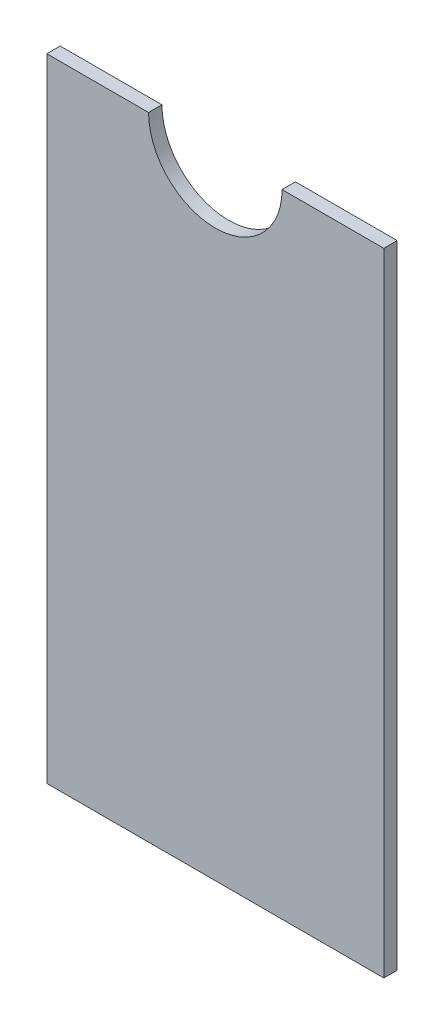
ISO-10303-21;
HEADER;
FILE_DESCRIPTION(('STEP AP214'),'2;1');
FILE_NAME('part.step','',(''),(''),'','','');
FILE_SCHEMA(('AUTOMOTIVE_DESIGN { 1 0 10303 214 1 1 1 1 }'));
ENDSEC;
DATA;
#1=APPLICATION_CONTEXT('core data for automotive mechanical design processes');
#2=APPLICATION_PROTOCOL_DEFINITION('international standard','automotive_design',2000,#1);
#3=PRODUCT_CONTEXT('',#1,'mechanical');
#4=PRODUCT('Part','Part','',(#3));
#5=PRODUCT_RELATED_PRODUCT_CATEGORY('part','',(#4));
#6=PRODUCT_DEFINITION_FORMATION('','',#4);
#7=PRODUCT_DEFINITION_CONTEXT('part definition',#1,'design');
#8=PRODUCT_DEFINITION('design','',#6,#7);
#9=PRODUCT_DEFINITION_SHAPE('','',#8);
#10=(LENGTH_UNIT() NAMED_UNIT(*) SI_UNIT(.MILLI.,.METRE.));
#11=(NAMED_UNIT(*) PLANE_ANGLE_UNIT() SI_UNIT($,.RADIAN.));
#12=(NAMED_UNIT(*) SI_UNIT($,.STERADIAN.) SOLID_ANGLE_UNIT());
#13=UNCERTAINTY_MEASURE_WITH_UNIT(LENGTH_MEASURE(1.E-05),#10,'distance_accuracy_value','');
#14=(GEOMETRIC_REPRESENTATION_CONTEXT(3) GLOBAL_UNCERTAINTY_ASSIGNED_CONTEXT((#13)) GLOBAL_UNIT_ASSIGNED_CONTEXT((#10,
#11,#12)) REPRESENTATION_CONTEXT('',''));
#15=CARTESIAN_POINT('',(0.,0.,0.));
#16=DIRECTION('',(0.,0.,1.));
#17=DIRECTION('',(1.,0.,0.));
#18=AXIS2_PLACEMENT_3D('',#15,#16,#17);
#19=CARTESIAN_POINT('',(40.,75.,3.175));
#20=DIRECTION('',(-1.,0.,0.));
#21=DIRECTION('',(0.,-1.,0.));
#22=AXIS2_PLACEMENT_3D('',#19,#20,#21);
#23=PLANE('',#22);
#24=DIRECTION('',(0.,1.,0.));
#25=VECTOR('',#24,1.);
#26=CARTESIAN_POINT('',(40.,75.,0.));
#27=LINE('',#26,#25);
#28=CARTESIAN_POINT('',(40.,-75.,0.));
#29=VERTEX_POINT('',#28);
#30=CARTESIAN_POINT('',(40.,75.,0.));
#31=VERTEX_POINT('',#30);
#32=EDGE_CURVE('E121',#29,#31,#27,.T.);
#33=ORIENTED_EDGE('',*,*,#32,.T.);
#34=DIRECTION('',(0.,0.,-1.));
#35=VECTOR('',#34,1.);
#36=CARTESIAN_POINT('',(40.,75.,3.175));
#37=LINE('',#36,#35);
#38=CARTESIAN_POINT('',(40.,75.,3.175));
#39=VERTEX_POINT('',#38);
#40=EDGE_CURVE('E11',#39,#31,#37,.T.);
#41=ORIENTED_EDGE('',*,*,#40,.F.);
#42=DIRECTION('',(0.,1.,0.));
#43=VECTOR('',#42,1.);
#44=CARTESIAN_POINT('',(40.,75.,3.175));
#45=LINE('',#44,#43);
#46=CARTESIAN_POINT('',(40.,-75.,3.175));
#47=VERTEX_POINT('',#46);
#48=EDGE_CURVE('E131',#47,#39,#45,.T.);
#49=ORIENTED_EDGE('',*,*,#48,.F.);
#50=DIRECTION('',(0.,0.,-1.));
#51=VECTOR('',#50,1.);
#52=CARTESIAN_POINT('',(40.,-75.,3.175));
#53=LINE('',#52,#51);
#54=EDGE_CURVE('E117',#47,#29,#53,.T.);
#55=ORIENTED_EDGE('',*,*,#54,.T.);
#56=EDGE_LOOP('',(#33,#41,#49,#55));
#57=FACE_BOUND('',#56,.T.);
#58=ADVANCED_FACE('F37',(#57),#23,.F.);
#59=CARTESIAN_POINT('',(15.85,75.,3.175));
#60=DIRECTION('',(0.,-1.,0.));
#61=DIRECTION('',(1.,0.,0.));
#62=AXIS2_PLACEMENT_3D('',#59,#60,#61);
#63=PLANE('',#62);
#64=DIRECTION('',(-1.,0.,0.));
#65=VECTOR('',#64,1.);
#66=CARTESIAN_POINT('',(15.85,75.,0.));
#67=LINE('',#66,#65);
#68=CARTESIAN_POINT('',(15.85,75.,0.));
#69=VERTEX_POINT('',#68);
#70=EDGE_CURVE('E124',#31,#69,#67,.T.);
#71=ORIENTED_EDGE('',*,*,#70,.T.);
#72=DIRECTION('',(0.,0.,-1.));
#73=VECTOR('',#72,1.);
#74=CARTESIAN_POINT('',(15.85,75.,3.175));
#75=LINE('',#74,#73);
#76=CARTESIAN_POINT('',(15.85,75.,3.175));
#77=VERTEX_POINT('',#76);
#78=EDGE_CURVE('E45',#77,#69,#75,.T.);
#79=ORIENTED_EDGE('',*,*,#78,.F.);
#80=DIRECTION('',(-1.,0.,0.));
#81=VECTOR('',#80,1.);
#82=CARTESIAN_POINT('',(15.85,75.,3.175));
#83=LINE('',#82,#81);
#84=EDGE_CURVE('E90',#39,#77,#83,.T.);
#85=ORIENTED_EDGE('',*,*,#84,.F.);
#86=ORIENTED_EDGE('',*,*,#40,.T.);
#87=EDGE_LOOP('',(#71,#79,#85,#86));
#88=FACE_BOUND('',#87,.T.);
#89=ADVANCED_FACE('F155',(#88),#63,.F.);
#90=CARTESIAN_POINT('',(0.,75.,3.175));
#91=DIRECTION('',(0.,0.,-1.));
#92=DIRECTION('',(-1.,0.,0.));
#93=AXIS2_PLACEMENT_3D('',#90,#91,#92);
#94=CYLINDRICAL_SURFACE('',#93,15.85);
#95=CARTESIAN_POINT('',(0.,75.,0.));
#96=DIRECTION('',(0.,0.,-1.));
#97=DIRECTION('',(1.,0.,0.));
#98=AXIS2_PLACEMENT_3D('',#95,#96,#97);
#99=CIRCLE('',#98,15.85);
#100=CARTESIAN_POINT('',(-15.85,75.,0.));
#101=VERTEX_POINT('',#100);
#102=EDGE_CURVE('E126',#69,#101,#99,.T.);
#103=ORIENTED_EDGE('',*,*,#102,.T.);
#104=DIRECTION('',(0.,0.,-1.));
#105=VECTOR('',#104,1.);
#106=CARTESIAN_POINT('',(-15.85,75.,3.175));
#107=LINE('',#106,#105);
#108=CARTESIAN_POINT('',(-15.85,75.,3.175));
#109=VERTEX_POINT('',#108);
#110=EDGE_CURVE('E112',#109,#101,#107,.T.);
#111=ORIENTED_EDGE('',*,*,#110,.F.);
#112=CARTESIAN_POINT('',(0.,75.,3.175));
#113=DIRECTION('',(0.,0.,-1.));
#114=DIRECTION('',(1.,0.,0.));
#115=AXIS2_PLACEMENT_3D('',#112,#113,#114);
#116=CIRCLE('',#115,15.85);
#117=EDGE_CURVE('E103',#77,#109,#116,.T.);
#118=ORIENTED_EDGE('',*,*,#117,.F.);
#119=ORIENTED_EDGE('',*,*,#78,.T.);
#120=EDGE_LOOP('',(#103,#111,#118,#119));
#121=FACE_BOUND('',#120,.T.);
#122=ADVANCED_FACE('F137',(#121),#94,.F.);
#123=CARTESIAN_POINT('',(-40.,75.,3.175));
#124=DIRECTION('',(0.,-1.,0.));
#125=DIRECTION('',(1.,0.,0.));
#126=AXIS2_PLACEMENT_3D('',#123,#124,#125);
#127=PLANE('',#126);
#128=DIRECTION('',(-1.,0.,0.));
#129=VECTOR('',#128,1.);
#130=CARTESIAN_POINT('',(-40.,75.,0.));
#131=LINE('',#130,#129);
#132=CARTESIAN_POINT('',(-40.,75.,0.));
#133=VERTEX_POINT('',#132);
#134=EDGE_CURVE('E111',#101,#133,#131,.T.);
#135=ORIENTED_EDGE('',*,*,#134,.T.);
#136=DIRECTION('',(0.,0.,-1.));
#137=VECTOR('',#136,1.);
#138=CARTESIAN_POINT('',(-40.,75.,3.175));
#139=LINE('',#138,#137);
#140=CARTESIAN_POINT('',(-40.,75.,3.175));
#141=VERTEX_POINT('',#140);
#142=EDGE_CURVE('E108',#141,#133,#139,.T.);
#143=ORIENTED_EDGE('',*,*,#142,.F.);
#144=DIRECTION('',(-1.,0.,0.));
#145=VECTOR('',#144,1.);
#146=CARTESIAN_POINT('',(-40.,75.,3.175));
#147=LINE('',#146,#145);
#148=EDGE_CURVE('E97',#109,#141,#147,.T.);
#149=ORIENTED_EDGE('',*,*,#148,.F.);
#150=ORIENTED_EDGE('',*,*,#110,.T.);
#151=EDGE_LOOP('',(#135,#143,#149,#150));
#152=FACE_BOUND('',#151,.T.);
#153=ADVANCED_FACE('F109',(#152),#127,.F.);
#154=CARTESIAN_POINT('',(-40.,75.,3.175));
#155=DIRECTION('',(1.,0.,0.));
#156=DIRECTION('',(0.,1.,0.));
#157=AXIS2_PLACEMENT_3D('',#154,#155,#156);
#158=PLANE('',#157);
#159=DIRECTION('',(0.,-1.,0.));
#160=VECTOR('',#159,1.);
#161=CARTESIAN_POINT('',(-40.,75.,0.));
#162=LINE('',#161,#160);
#163=CARTESIAN_POINT('',(-40.,-75.,0.));
#164=VERTEX_POINT('',#163);
#165=EDGE_CURVE('E76',#133,#164,#162,.T.);
#166=ORIENTED_EDGE('',*,*,#165,.T.);
#167=DIRECTION('',(0.,0.,-1.));
#168=VECTOR('',#167,1.);
#169=CARTESIAN_POINT('',(-40.,-75.,3.175));
#170=LINE('',#169,#168);
#171=CARTESIAN_POINT('',(-40.,-75.,3.175));
#172=VERTEX_POINT('',#171);
#173=EDGE_CURVE('E113',#172,#164,#170,.T.);
#174=ORIENTED_EDGE('',*,*,#173,.F.);
#175=DIRECTION('',(0.,-1.,0.));
#176=VECTOR('',#175,1.);
#177=CARTESIAN_POINT('',(-40.,75.,3.175));
#178=LINE('',#177,#176);
#179=EDGE_CURVE('E101',#141,#172,#178,.T.);
#180=ORIENTED_EDGE('',*,*,#179,.F.);
#181=ORIENTED_EDGE('',*,*,#142,.T.);
#182=EDGE_LOOP('',(#166,#174,#180,#181));
#183=FACE_BOUND('',#182,.T.);
#184=ADVANCED_FACE('F115',(#183),#158,.F.);
#185=CARTESIAN_POINT('',(-40.,-75.,3.175));
#186=DIRECTION('',(0.,1.,0.));
#187=DIRECTION('',(0.,0.,1.));
#188=AXIS2_PLACEMENT_3D('',#185,#186,#187);
#189=PLANE('',#188);
#190=DIRECTION('',(1.,0.,0.));
#191=VECTOR('',#190,1.);
#192=CARTESIAN_POINT('',(-40.,-75.,0.));
#193=LINE('',#192,#191);
#194=EDGE_CURVE('E82',#164,#29,#193,.T.);
#195=ORIENTED_EDGE('',*,*,#194,.T.);
#196=ORIENTED_EDGE('',*,*,#54,.F.);
#197=DIRECTION('',(1.,0.,0.));
#198=VECTOR('',#197,1.);
#199=CARTESIAN_POINT('',(-40.,-75.,3.175));
#200=LINE('',#199,#198);
#201=EDGE_CURVE('E53',#172,#47,#200,.T.);
#202=ORIENTED_EDGE('',*,*,#201,.F.);
#203=ORIENTED_EDGE('',*,*,#173,.T.);
#204=EDGE_LOOP('',(#195,#196,#202,#203));
#205=FACE_BOUND('',#204,.T.);
#206=ADVANCED_FACE('F144',(#205),#189,.F.);
#207=CARTESIAN_POINT('',(0.,75.,3.175));
#208=DIRECTION('',(0.,0.,1.));
#209=DIRECTION('',(1.,0.,0.));
#210=AXIS2_PLACEMENT_3D('',#207,#208,#209);
#211=PLANE('',#210);
#212=ORIENTED_EDGE('',*,*,#48,.T.);
#213=ORIENTED_EDGE('',*,*,#84,.T.);
#214=ORIENTED_EDGE('',*,*,#117,.T.);
#215=ORIENTED_EDGE('',*,*,#148,.T.);
#216=ORIENTED_EDGE('',*,*,#179,.T.);
#217=ORIENTED_EDGE('',*,*,#201,.T.);
#218=EDGE_LOOP('',(#212,#213,#214,#215,#216,#217));
#219=FACE_BOUND('',#218,.T.);
#220=ADVANCED_FACE('F99',(#219),#211,.T.);
#221=CARTESIAN_POINT('',(0.,75.,0.));
#222=DIRECTION('',(0.,0.,1.));
#223=DIRECTION('',(1.,0.,0.));
#224=AXIS2_PLACEMENT_3D('',#221,#222,#223);
#225=PLANE('',#224);
#226=ORIENTED_EDGE('',*,*,#32,.F.);
#227=ORIENTED_EDGE('',*,*,#194,.F.);
#228=ORIENTED_EDGE('',*,*,#165,.F.);
#229=ORIENTED_EDGE('',*,*,#134,.F.);
#230=ORIENTED_EDGE('',*,*,#102,.F.);
#231=ORIENTED_EDGE('',*,*,#70,.F.);
#232=EDGE_LOOP('',(#226,#227,#228,#229,#230,#231));
#233=FACE_BOUND('',#232,.T.);
#234=ADVANCED_FACE('F140',(#233),#225,.F.);
#235=CLOSED_SHELL('',(#58,#89,#122,#153,#184,#206,#220,#234));
#236=MANIFOLD_SOLID_BREP('B2',#235);
#237=ADVANCED_BREP_SHAPE_REPRESENTATION('',(#18,#236),#14);
#238=SHAPE_DEFINITION_REPRESENTATION(#9,#237);
ENDSEC;
END-ISO-10303-21;
